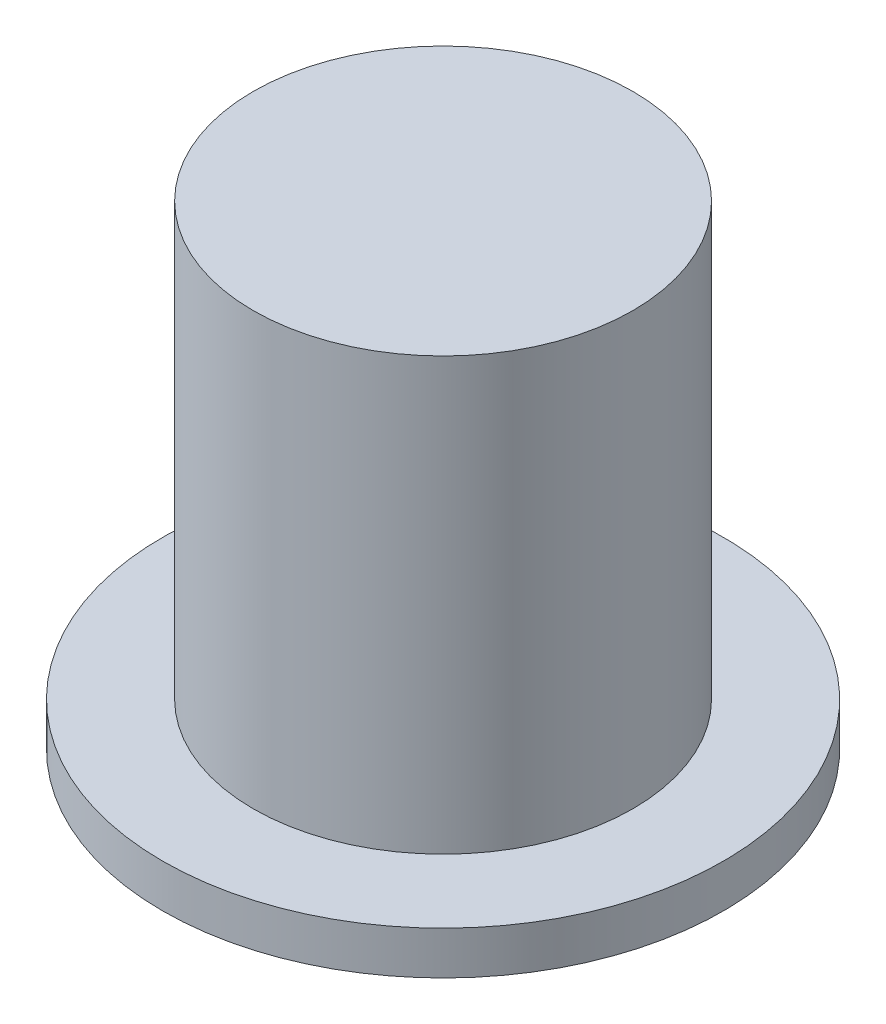
ISO-10303-21;
HEADER;
FILE_DESCRIPTION(('STEP AP214'),'2;1');
FILE_NAME('part.step','',(''),(''),'','','');
FILE_SCHEMA(('AUTOMOTIVE_DESIGN { 1 0 10303 214 1 1 1 1 }'));
ENDSEC;
DATA;
#1=APPLICATION_CONTEXT('core data for automotive mechanical design processes');
#2=APPLICATION_PROTOCOL_DEFINITION('international standard','automotive_design',2000,#1);
#3=PRODUCT_CONTEXT('',#1,'mechanical');
#4=PRODUCT('Part','Part','',(#3));
#5=PRODUCT_RELATED_PRODUCT_CATEGORY('part','',(#4));
#6=PRODUCT_DEFINITION_FORMATION('','',#4);
#7=PRODUCT_DEFINITION_CONTEXT('part definition',#1,'design');
#8=PRODUCT_DEFINITION('design','',#6,#7);
#9=PRODUCT_DEFINITION_SHAPE('','',#8);
#10=(LENGTH_UNIT() NAMED_UNIT(*) SI_UNIT(.MILLI.,.METRE.));
#11=(NAMED_UNIT(*) PLANE_ANGLE_UNIT() SI_UNIT($,.RADIAN.));
#12=(NAMED_UNIT(*) SI_UNIT($,.STERADIAN.) SOLID_ANGLE_UNIT());
#13=UNCERTAINTY_MEASURE_WITH_UNIT(LENGTH_MEASURE(1.E-05),#10,'distance_accuracy_value','');
#14=(GEOMETRIC_REPRESENTATION_CONTEXT(3) GLOBAL_UNCERTAINTY_ASSIGNED_CONTEXT((#13)) GLOBAL_UNIT_ASSIGNED_CONTEXT((#10,
#11,#12)) REPRESENTATION_CONTEXT('',''));
#15=CARTESIAN_POINT('',(0.,0.,0.));
#16=DIRECTION('',(0.,0.,1.));
#17=DIRECTION('',(1.,0.,0.));
#18=AXIS2_PLACEMENT_3D('',#15,#16,#17);
#19=CARTESIAN_POINT('',(0.,0.5,0.));
#20=DIRECTION('',(0.,-1.,0.));
#21=DIRECTION('',(0.,0.,-1.));
#22=AXIS2_PLACEMENT_3D('',#19,#20,#21);
#23=CYLINDRICAL_SURFACE('',#22,3.25);
#24=CARTESIAN_POINT('',(0.,0.5,0.));
#25=DIRECTION('',(0.,1.,0.));
#26=DIRECTION('',(0.,0.,1.));
#27=AXIS2_PLACEMENT_3D('',#24,#25,#26);
#28=CIRCLE('',#27,3.25);
#29=CARTESIAN_POINT('',(0.,0.5,3.25));
#30=VERTEX_POINT('',#29);
#31=EDGE_CURVE('E49',#30,#30,#28,.T.);
#32=ORIENTED_EDGE('',*,*,#31,.F.);
#33=EDGE_LOOP('',(#32));
#34=FACE_BOUND('',#33,.T.);
#35=CARTESIAN_POINT('',(0.,0.,0.));
#36=DIRECTION('',(0.,1.,0.));
#37=DIRECTION('',(0.,0.,1.));
#38=AXIS2_PLACEMENT_3D('',#35,#36,#37);
#39=CIRCLE('',#38,3.25);
#40=CARTESIAN_POINT('',(0.,0.,3.25));
#41=VERTEX_POINT('',#40);
#42=EDGE_CURVE('E44',#41,#41,#39,.T.);
#43=ORIENTED_EDGE('',*,*,#42,.T.);
#44=EDGE_LOOP('',(#43));
#45=FACE_BOUND('',#44,.T.);
#46=ADVANCED_FACE('F41',(#34,#45),#23,.T.);
#47=CARTESIAN_POINT('',(0.,0.5,0.));
#48=DIRECTION('',(0.,1.,0.));
#49=DIRECTION('',(0.,0.,1.));
#50=AXIS2_PLACEMENT_3D('',#47,#48,#49);
#51=PLANE('',#50);
#52=CARTESIAN_POINT('',(0.,0.5,0.));
#53=DIRECTION('',(0.,1.,0.));
#54=DIRECTION('',(0.,0.,1.));
#55=AXIS2_PLACEMENT_3D('',#52,#53,#54);
#56=CIRCLE('',#55,2.2);
#57=CARTESIAN_POINT('',(0.,0.5,2.2));
#58=VERTEX_POINT('',#57);
#59=EDGE_CURVE('E10',#58,#58,#56,.T.);
#60=ORIENTED_EDGE('',*,*,#59,.F.);
#61=EDGE_LOOP('',(#60));
#62=FACE_BOUND('',#61,.T.);
#63=ORIENTED_EDGE('',*,*,#31,.T.);
#64=EDGE_LOOP('',(#63));
#65=FACE_BOUND('',#64,.T.);
#66=ADVANCED_FACE('F69',(#62,#65),#51,.T.);
#67=CARTESIAN_POINT('',(0.,0.,0.));
#68=DIRECTION('',(0.,1.,0.));
#69=DIRECTION('',(0.,0.,1.));
#70=AXIS2_PLACEMENT_3D('',#67,#68,#69);
#71=PLANE('',#70);
#72=ORIENTED_EDGE('',*,*,#42,.F.);
#73=EDGE_LOOP('',(#72));
#74=FACE_BOUND('',#73,.T.);
#75=ADVANCED_FACE('F66',(#74),#71,.F.);
#76=CARTESIAN_POINT('',(0.,5.5,0.));
#77=DIRECTION('',(0.,-1.,0.));
#78=DIRECTION('',(0.,0.,-1.));
#79=AXIS2_PLACEMENT_3D('',#76,#77,#78);
#80=CYLINDRICAL_SURFACE('',#79,2.2);
#81=CARTESIAN_POINT('',(0.,5.5,0.));
#82=DIRECTION('',(0.,1.,0.));
#83=DIRECTION('',(0.,0.,1.));
#84=AXIS2_PLACEMENT_3D('',#81,#82,#83);
#85=CIRCLE('',#84,2.2);
#86=CARTESIAN_POINT('',(0.,5.5,2.2));
#87=VERTEX_POINT('',#86);
#88=EDGE_CURVE('E56',#87,#87,#85,.T.);
#89=ORIENTED_EDGE('',*,*,#88,.F.);
#90=EDGE_LOOP('',(#89));
#91=FACE_BOUND('',#90,.T.);
#92=ORIENTED_EDGE('',*,*,#59,.T.);
#93=EDGE_LOOP('',(#92));
#94=FACE_BOUND('',#93,.T.);
#95=ADVANCED_FACE('F68',(#91,#94),#80,.T.);
#96=CARTESIAN_POINT('',(0.,5.5,0.));
#97=DIRECTION('',(0.,1.,0.));
#98=DIRECTION('',(0.,0.,1.));
#99=AXIS2_PLACEMENT_3D('',#96,#97,#98);
#100=PLANE('',#99);
#101=ORIENTED_EDGE('',*,*,#88,.T.);
#102=EDGE_LOOP('',(#101));
#103=FACE_BOUND('',#102,.T.);
#104=ADVANCED_FACE('F74',(#103),#100,.T.);
#105=CLOSED_SHELL('',(#46,#66,#75,#95,#104));
#106=MANIFOLD_SOLID_BREP('B2',#105);
#107=ADVANCED_BREP_SHAPE_REPRESENTATION('',(#18,#106),#14);
#108=SHAPE_DEFINITION_REPRESENTATION(#9,#107);
ENDSEC;
END-ISO-10303-21;
